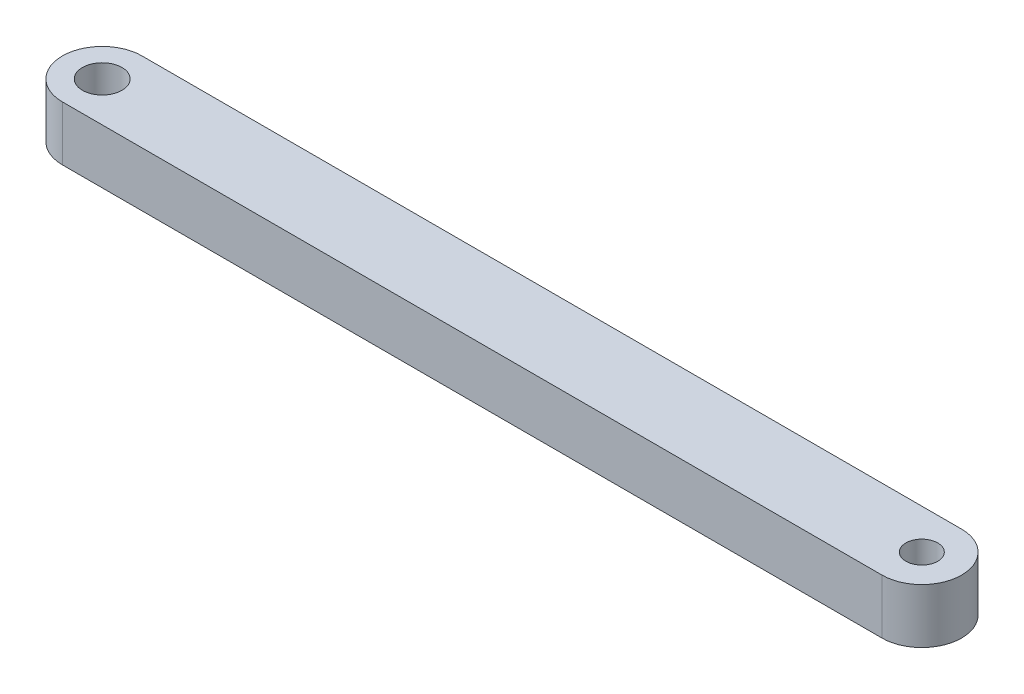
ISO-10303-21;
HEADER;
FILE_DESCRIPTION(('STEP AP214'),'2;1');
FILE_NAME('part.step','',(''),(''),'','','');
FILE_SCHEMA(('AUTOMOTIVE_DESIGN { 1 0 10303 214 1 1 1 1 }'));
ENDSEC;
DATA;
#1=APPLICATION_CONTEXT('core data for automotive mechanical design processes');
#2=APPLICATION_PROTOCOL_DEFINITION('international standard','automotive_design',2000,#1);
#3=PRODUCT_CONTEXT('',#1,'mechanical');
#4=PRODUCT('Part','Part','',(#3));
#5=PRODUCT_RELATED_PRODUCT_CATEGORY('part','',(#4));
#6=PRODUCT_DEFINITION_FORMATION('','',#4);
#7=PRODUCT_DEFINITION_CONTEXT('part definition',#1,'design');
#8=PRODUCT_DEFINITION('design','',#6,#7);
#9=PRODUCT_DEFINITION_SHAPE('','',#8);
#10=(LENGTH_UNIT() NAMED_UNIT(*) SI_UNIT(.MILLI.,.METRE.));
#11=(NAMED_UNIT(*) PLANE_ANGLE_UNIT() SI_UNIT($,.RADIAN.));
#12=(NAMED_UNIT(*) SI_UNIT($,.STERADIAN.) SOLID_ANGLE_UNIT());
#13=UNCERTAINTY_MEASURE_WITH_UNIT(LENGTH_MEASURE(1.E-05),#10,'distance_accuracy_value','');
#14=(GEOMETRIC_REPRESENTATION_CONTEXT(3) GLOBAL_UNCERTAINTY_ASSIGNED_CONTEXT((#13)) GLOBAL_UNIT_ASSIGNED_CONTEXT((#10,
#11,#12)) REPRESENTATION_CONTEXT('',''));
#15=CARTESIAN_POINT('',(0.,0.,0.));
#16=DIRECTION('',(0.,0.,1.));
#17=DIRECTION('',(1.,0.,0.));
#18=AXIS2_PLACEMENT_3D('',#15,#16,#17);
#19=CARTESIAN_POINT('',(-22.225,2.9591,0.));
#20=DIRECTION('',(0.,1.,0.));
#21=DIRECTION('',(0.,0.,1.));
#22=AXIS2_PLACEMENT_3D('',#19,#20,#21);
#23=PLANE('',#22);
#24=CARTESIAN_POINT('',(22.225,2.9591,0.));
#25=DIRECTION('',(0.,1.,0.));
#26=DIRECTION('',(0.,0.,1.));
#27=AXIS2_PLACEMENT_3D('',#24,#25,#26);
#28=CIRCLE('',#27,0.8636);
#29=CARTESIAN_POINT('',(22.225,2.9591,0.863599999999992));
#30=VERTEX_POINT('',#29);
#31=EDGE_CURVE('E100',#30,#30,#28,.T.);
#32=ORIENTED_EDGE('',*,*,#31,.F.);
#33=EDGE_LOOP('',(#32));
#34=FACE_BOUND('',#33,.T.);
#35=CARTESIAN_POINT('',(-22.225,2.9591,0.));
#36=DIRECTION('',(0.,1.,0.));
#37=DIRECTION('',(0.,0.,1.));
#38=AXIS2_PLACEMENT_3D('',#35,#36,#37);
#39=CIRCLE('',#38,2.15900000000001);
#40=CARTESIAN_POINT('',(-22.225,2.9591,-2.15900000000001));
#41=VERTEX_POINT('',#40);
#42=CARTESIAN_POINT('',(-22.225,2.9591,2.15900000000001));
#43=VERTEX_POINT('',#42);
#44=EDGE_CURVE('E85',#41,#43,#39,.T.);
#45=ORIENTED_EDGE('',*,*,#44,.T.);
#46=DIRECTION('',(1.,0.,0.));
#47=VECTOR('',#46,1.);
#48=CARTESIAN_POINT('',(-22.225,2.9591,2.15900000000001));
#49=LINE('',#48,#47);
#50=CARTESIAN_POINT('',(22.225,2.9591,2.159));
#51=VERTEX_POINT('',#50);
#52=EDGE_CURVE('E80',#43,#51,#49,.T.);
#53=ORIENTED_EDGE('',*,*,#52,.T.);
#54=CARTESIAN_POINT('',(22.225,2.9591,0.));
#55=DIRECTION('',(0.,1.,0.));
#56=DIRECTION('',(0.,0.,1.));
#57=AXIS2_PLACEMENT_3D('',#54,#55,#56);
#58=CIRCLE('',#57,2.15900000000001);
#59=CARTESIAN_POINT('',(22.225,2.9591,-2.15900000000002));
#60=VERTEX_POINT('',#59);
#61=EDGE_CURVE('E83',#51,#60,#58,.T.);
#62=ORIENTED_EDGE('',*,*,#61,.T.);
#63=DIRECTION('',(-1.,0.,0.));
#64=VECTOR('',#63,1.);
#65=CARTESIAN_POINT('',(-22.225,2.9591,-2.15900000000001));
#66=LINE('',#65,#64);
#67=EDGE_CURVE('E50',#60,#41,#66,.T.);
#68=ORIENTED_EDGE('',*,*,#67,.T.);
#69=EDGE_LOOP('',(#45,#53,#62,#68));
#70=FACE_BOUND('',#69,.T.);
#71=CARTESIAN_POINT('',(-22.225,2.9591,0.));
#72=DIRECTION('',(0.,1.,0.));
#73=DIRECTION('',(0.,0.,1.));
#74=AXIS2_PLACEMENT_3D('',#71,#72,#73);
#75=CIRCLE('',#74,1.07315);
#76=CARTESIAN_POINT('',(-22.225,2.9591,1.07315));
#77=VERTEX_POINT('',#76);
#78=EDGE_CURVE('E115',#77,#77,#75,.T.);
#79=ORIENTED_EDGE('',*,*,#78,.F.);
#80=EDGE_LOOP('',(#79));
#81=FACE_BOUND('',#80,.T.);
#82=ADVANCED_FACE('F33',(#34,#70,#81),#23,.T.);
#83=CARTESIAN_POINT('',(-22.225,0.,0.));
#84=DIRECTION('',(0.,1.,0.));
#85=DIRECTION('',(0.,0.,1.));
#86=AXIS2_PLACEMENT_3D('',#83,#84,#85);
#87=PLANE('',#86);
#88=CARTESIAN_POINT('',(22.225,0.,0.));
#89=DIRECTION('',(0.,1.,0.));
#90=DIRECTION('',(0.,0.,1.));
#91=AXIS2_PLACEMENT_3D('',#88,#89,#90);
#92=CIRCLE('',#91,0.8636);
#93=CARTESIAN_POINT('',(22.225,0.,0.863599999999992));
#94=VERTEX_POINT('',#93);
#95=EDGE_CURVE('E112',#94,#94,#92,.T.);
#96=ORIENTED_EDGE('',*,*,#95,.T.);
#97=EDGE_LOOP('',(#96));
#98=FACE_BOUND('',#97,.T.);
#99=CARTESIAN_POINT('',(-22.225,0.,0.));
#100=DIRECTION('',(0.,1.,0.));
#101=DIRECTION('',(0.,0.,1.));
#102=AXIS2_PLACEMENT_3D('',#99,#100,#101);
#103=CIRCLE('',#102,2.15900000000001);
#104=CARTESIAN_POINT('',(-22.225,0.,-2.15900000000001));
#105=VERTEX_POINT('',#104);
#106=CARTESIAN_POINT('',(-22.225,0.,2.15900000000001));
#107=VERTEX_POINT('',#106);
#108=EDGE_CURVE('E97',#105,#107,#103,.T.);
#109=ORIENTED_EDGE('',*,*,#108,.F.);
#110=DIRECTION('',(-1.,0.,0.));
#111=VECTOR('',#110,1.);
#112=CARTESIAN_POINT('',(-22.225,0.,-2.15900000000001));
#113=LINE('',#112,#111);
#114=CARTESIAN_POINT('',(22.225,0.,-2.15900000000002));
#115=VERTEX_POINT('',#114);
#116=EDGE_CURVE('E73',#115,#105,#113,.T.);
#117=ORIENTED_EDGE('',*,*,#116,.F.);
#118=CARTESIAN_POINT('',(22.225,0.,0.));
#119=DIRECTION('',(0.,1.,0.));
#120=DIRECTION('',(0.,0.,1.));
#121=AXIS2_PLACEMENT_3D('',#118,#119,#120);
#122=CIRCLE('',#121,2.15900000000001);
#123=CARTESIAN_POINT('',(22.225,0.,2.159));
#124=VERTEX_POINT('',#123);
#125=EDGE_CURVE('E67',#124,#115,#122,.T.);
#126=ORIENTED_EDGE('',*,*,#125,.F.);
#127=DIRECTION('',(1.,0.,0.));
#128=VECTOR('',#127,1.);
#129=CARTESIAN_POINT('',(-22.225,0.,2.15900000000001));
#130=LINE('',#129,#128);
#131=EDGE_CURVE('E89',#107,#124,#130,.T.);
#132=ORIENTED_EDGE('',*,*,#131,.F.);
#133=EDGE_LOOP('',(#109,#117,#126,#132));
#134=FACE_BOUND('',#133,.T.);
#135=CARTESIAN_POINT('',(-22.225,0.,0.));
#136=DIRECTION('',(0.,1.,0.));
#137=DIRECTION('',(0.,0.,1.));
#138=AXIS2_PLACEMENT_3D('',#135,#136,#137);
#139=CIRCLE('',#138,1.07315);
#140=CARTESIAN_POINT('',(-22.225,0.,1.07315));
#141=VERTEX_POINT('',#140);
#142=EDGE_CURVE('E118',#141,#141,#139,.T.);
#143=ORIENTED_EDGE('',*,*,#142,.T.);
#144=EDGE_LOOP('',(#143));
#145=FACE_BOUND('',#144,.T.);
#146=ADVANCED_FACE('F108',(#98,#134,#145),#87,.F.);
#147=CARTESIAN_POINT('',(-22.225,2.9591,0.));
#148=DIRECTION('',(0.,-1.,0.));
#149=DIRECTION('',(0.,0.,-1.));
#150=AXIS2_PLACEMENT_3D('',#147,#148,#149);
#151=CYLINDRICAL_SURFACE('',#150,2.15900000000001);
#152=ORIENTED_EDGE('',*,*,#108,.T.);
#153=DIRECTION('',(0.,-1.,0.));
#154=VECTOR('',#153,1.);
#155=CARTESIAN_POINT('',(-22.225,2.9591,2.15900000000001));
#156=LINE('',#155,#154);
#157=EDGE_CURVE('E11',#43,#107,#156,.T.);
#158=ORIENTED_EDGE('',*,*,#157,.F.);
#159=ORIENTED_EDGE('',*,*,#44,.F.);
#160=DIRECTION('',(0.,-1.,0.));
#161=VECTOR('',#160,1.);
#162=CARTESIAN_POINT('',(-22.225,2.9591,-2.15900000000001));
#163=LINE('',#162,#161);
#164=EDGE_CURVE('E93',#41,#105,#163,.T.);
#165=ORIENTED_EDGE('',*,*,#164,.T.);
#166=EDGE_LOOP('',(#152,#158,#159,#165));
#167=FACE_BOUND('',#166,.T.);
#168=ADVANCED_FACE('F35',(#167),#151,.T.);
#169=CARTESIAN_POINT('',(-22.225,2.9591,2.15900000000001));
#170=DIRECTION('',(0.,0.,-1.));
#171=DIRECTION('',(-1.,0.,0.));
#172=AXIS2_PLACEMENT_3D('',#169,#170,#171);
#173=PLANE('',#172);
#174=ORIENTED_EDGE('',*,*,#131,.T.);
#175=DIRECTION('',(0.,-1.,0.));
#176=VECTOR('',#175,1.);
#177=CARTESIAN_POINT('',(22.225,2.9591,2.159));
#178=LINE('',#177,#176);
#179=EDGE_CURVE('E42',#51,#124,#178,.T.);
#180=ORIENTED_EDGE('',*,*,#179,.F.);
#181=ORIENTED_EDGE('',*,*,#52,.F.);
#182=ORIENTED_EDGE('',*,*,#157,.T.);
#183=EDGE_LOOP('',(#174,#180,#181,#182));
#184=FACE_BOUND('',#183,.T.);
#185=ADVANCED_FACE('F88',(#184),#173,.F.);
#186=CARTESIAN_POINT('',(22.225,2.9591,0.));
#187=DIRECTION('',(0.,-1.,0.));
#188=DIRECTION('',(0.,0.,-1.));
#189=AXIS2_PLACEMENT_3D('',#186,#187,#188);
#190=CYLINDRICAL_SURFACE('',#189,2.15900000000001);
#191=ORIENTED_EDGE('',*,*,#125,.T.);
#192=DIRECTION('',(0.,-1.,0.));
#193=VECTOR('',#192,1.);
#194=CARTESIAN_POINT('',(22.225,2.9591,-2.15900000000002));
#195=LINE('',#194,#193);
#196=EDGE_CURVE('E90',#60,#115,#195,.T.);
#197=ORIENTED_EDGE('',*,*,#196,.F.);
#198=ORIENTED_EDGE('',*,*,#61,.F.);
#199=ORIENTED_EDGE('',*,*,#179,.T.);
#200=EDGE_LOOP('',(#191,#197,#198,#199));
#201=FACE_BOUND('',#200,.T.);
#202=ADVANCED_FACE('F91',(#201),#190,.T.);
#203=CARTESIAN_POINT('',(-22.225,2.9591,-2.15900000000001));
#204=DIRECTION('',(0.,0.,1.));
#205=DIRECTION('',(1.,0.,0.));
#206=AXIS2_PLACEMENT_3D('',#203,#204,#205);
#207=PLANE('',#206);
#208=ORIENTED_EDGE('',*,*,#116,.T.);
#209=ORIENTED_EDGE('',*,*,#164,.F.);
#210=ORIENTED_EDGE('',*,*,#67,.F.);
#211=ORIENTED_EDGE('',*,*,#196,.T.);
#212=EDGE_LOOP('',(#208,#209,#210,#211));
#213=FACE_BOUND('',#212,.T.);
#214=ADVANCED_FACE('F105',(#213),#207,.F.);
#215=CARTESIAN_POINT('',(22.225,2.9591,0.));
#216=DIRECTION('',(0.,-1.,0.));
#217=DIRECTION('',(0.,0.,-1.));
#218=AXIS2_PLACEMENT_3D('',#215,#216,#217);
#219=CYLINDRICAL_SURFACE('',#218,0.8636);
#220=ORIENTED_EDGE('',*,*,#31,.T.);
#221=EDGE_LOOP('',(#220));
#222=FACE_BOUND('',#221,.T.);
#223=ORIENTED_EDGE('',*,*,#95,.F.);
#224=EDGE_LOOP('',(#223));
#225=FACE_BOUND('',#224,.T.);
#226=ADVANCED_FACE('F136',(#222,#225),#219,.F.);
#227=CARTESIAN_POINT('',(-22.225,2.9591,0.));
#228=DIRECTION('',(0.,-1.,0.));
#229=DIRECTION('',(0.,0.,-1.));
#230=AXIS2_PLACEMENT_3D('',#227,#228,#229);
#231=CYLINDRICAL_SURFACE('',#230,1.07315);
#232=ORIENTED_EDGE('',*,*,#78,.T.);
#233=EDGE_LOOP('',(#232));
#234=FACE_BOUND('',#233,.T.);
#235=ORIENTED_EDGE('',*,*,#142,.F.);
#236=EDGE_LOOP('',(#235));
#237=FACE_BOUND('',#236,.T.);
#238=ADVANCED_FACE('F124',(#234,#237),#231,.F.);
#239=CLOSED_SHELL('',(#82,#146,#168,#185,#202,#214,#226,#238));
#240=MANIFOLD_SOLID_BREP('B2',#239);
#241=ADVANCED_BREP_SHAPE_REPRESENTATION('',(#18,#240),#14);
#242=SHAPE_DEFINITION_REPRESENTATION(#9,#241);
ENDSEC;
END-ISO-10303-21;
